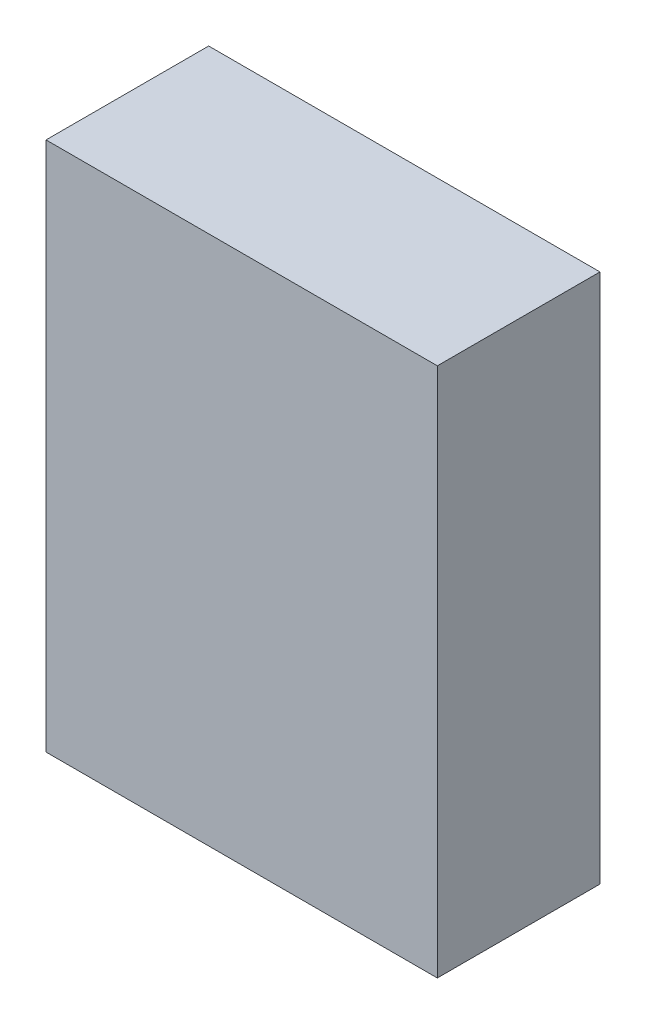
ISO-10303-21;
HEADER;
FILE_DESCRIPTION(('STEP AP214'),'2;1');
FILE_NAME('part.step','',(''),(''),'','','');
FILE_SCHEMA(('AUTOMOTIVE_DESIGN { 1 0 10303 214 1 1 1 1 }'));
ENDSEC;
DATA;
#1=APPLICATION_CONTEXT('core data for automotive mechanical design processes');
#2=APPLICATION_PROTOCOL_DEFINITION('international standard','automotive_design',2000,#1);
#3=PRODUCT_CONTEXT('',#1,'mechanical');
#4=PRODUCT('Part','Part','',(#3));
#5=PRODUCT_RELATED_PRODUCT_CATEGORY('part','',(#4));
#6=PRODUCT_DEFINITION_FORMATION('','',#4);
#7=PRODUCT_DEFINITION_CONTEXT('part definition',#1,'design');
#8=PRODUCT_DEFINITION('design','',#6,#7);
#9=PRODUCT_DEFINITION_SHAPE('','',#8);
#10=(LENGTH_UNIT() NAMED_UNIT(*) SI_UNIT(.MILLI.,.METRE.));
#11=(NAMED_UNIT(*) PLANE_ANGLE_UNIT() SI_UNIT($,.RADIAN.));
#12=(NAMED_UNIT(*) SI_UNIT($,.STERADIAN.) SOLID_ANGLE_UNIT());
#13=UNCERTAINTY_MEASURE_WITH_UNIT(LENGTH_MEASURE(1.E-05),#10,'distance_accuracy_value','');
#14=(GEOMETRIC_REPRESENTATION_CONTEXT(3) GLOBAL_UNCERTAINTY_ASSIGNED_CONTEXT((#13)) GLOBAL_UNIT_ASSIGNED_CONTEXT((#10,
#11,#12)) REPRESENTATION_CONTEXT('',''));
#15=CARTESIAN_POINT('',(0.,0.,0.));
#16=DIRECTION('',(0.,0.,1.));
#17=DIRECTION('',(1.,0.,0.));
#18=AXIS2_PLACEMENT_3D('',#15,#16,#17);
#19=CARTESIAN_POINT('',(0.27500072,-0.37260022,0.2286));
#20=DIRECTION('',(0.,0.,-1.));
#21=DIRECTION('',(-1.,0.,0.));
#22=AXIS2_PLACEMENT_3D('',#19,#20,#21);
#23=PLANE('',#22);
#24=DIRECTION('',(1.,0.,0.));
#25=VECTOR('',#24,1.);
#26=CARTESIAN_POINT('',(0.27500072,0.37260276,0.2286));
#27=LINE('',#26,#25);
#28=CARTESIAN_POINT('',(0.27500072,0.37260276,0.2286));
#29=VERTEX_POINT('',#28);
#30=CARTESIAN_POINT('',(-0.27500072,0.37260276,0.2286));
#31=VERTEX_POINT('',#30);
#32=EDGE_CURVE('E55',#29,#31,#27,.F.);
#33=ORIENTED_EDGE('',*,*,#32,.T.);
#34=DIRECTION('',(0.,1.,0.));
#35=VECTOR('',#34,1.);
#36=CARTESIAN_POINT('',(-0.27500072,0.37260276,0.2286));
#37=LINE('',#36,#35);
#38=CARTESIAN_POINT('',(-0.27500072,-0.37260149,0.2286));
#39=VERTEX_POINT('',#38);
#40=EDGE_CURVE('E57',#31,#39,#37,.F.);
#41=ORIENTED_EDGE('',*,*,#40,.T.);
#42=DIRECTION('',(-0.999999999989336,-4.61816972146955E-06,0.));
#43=VECTOR('',#42,1.);
#44=CARTESIAN_POINT('',(-0.27500072,-0.37260276,0.2286));
#45=LINE('',#44,#43);
#46=CARTESIAN_POINT('',(0.27500072,-0.372600220000001,0.2286));
#47=VERTEX_POINT('',#46);
#48=EDGE_CURVE('E20',#39,#47,#45,.F.);
#49=ORIENTED_EDGE('',*,*,#48,.T.);
#50=DIRECTION('',(0.,1.,0.));
#51=VECTOR('',#50,1.);
#52=CARTESIAN_POINT('',(0.27500072,-0.37260022,0.2286));
#53=LINE('',#52,#51);
#54=EDGE_CURVE('E80',#47,#29,#53,.T.);
#55=ORIENTED_EDGE('',*,*,#54,.T.);
#56=EDGE_LOOP('',(#33,#41,#49,#55));
#57=FACE_BOUND('',#56,.T.);
#58=ADVANCED_FACE('F17',(#57),#23,.F.);
#59=CARTESIAN_POINT('',(-0.27500072,-0.37260276,0.));
#60=DIRECTION('',(-4.61816972146955E-06,0.999999999989336,0.));
#61=DIRECTION('',(-0.999999999989336,-4.61816972146955E-06,0.));
#62=AXIS2_PLACEMENT_3D('',#59,#60,#61);
#63=PLANE('',#62);
#64=DIRECTION('',(0.,0.,1.));
#65=VECTOR('',#64,1.);
#66=CARTESIAN_POINT('',(0.27500072,-0.37260022,0.));
#67=LINE('',#66,#65);
#68=CARTESIAN_POINT('',(0.27500072,-0.372600220000001,0.));
#69=VERTEX_POINT('',#68);
#70=EDGE_CURVE('E68',#69,#47,#67,.T.);
#71=ORIENTED_EDGE('',*,*,#70,.T.);
#72=ORIENTED_EDGE('',*,*,#48,.F.);
#73=DIRECTION('',(0.,0.,-1.));
#74=VECTOR('',#73,1.);
#75=CARTESIAN_POINT('',(-0.27500072,-0.37260276,0.));
#76=LINE('',#75,#74);
#77=CARTESIAN_POINT('',(-0.27500072,-0.372602125,0.));
#78=VERTEX_POINT('',#77);
#79=EDGE_CURVE('E63',#39,#78,#76,.T.);
#80=ORIENTED_EDGE('',*,*,#79,.T.);
#81=DIRECTION('',(-1.,0.,0.));
#82=VECTOR('',#81,1.);
#83=CARTESIAN_POINT('',(0.27500072,-0.37260022,0.));
#84=LINE('',#83,#82);
#85=EDGE_CURVE('E83',#69,#78,#84,.T.);
#86=ORIENTED_EDGE('',*,*,#85,.F.);
#87=EDGE_LOOP('',(#71,#72,#80,#86));
#88=FACE_BOUND('',#87,.T.);
#89=ADVANCED_FACE('F65',(#88),#63,.F.);
#90=CARTESIAN_POINT('',(-0.27500072,0.37260276,0.));
#91=DIRECTION('',(1.,0.,0.));
#92=DIRECTION('',(0.,0.,-1.));
#93=AXIS2_PLACEMENT_3D('',#90,#91,#92);
#94=PLANE('',#93);
#95=ORIENTED_EDGE('',*,*,#79,.F.);
#96=ORIENTED_EDGE('',*,*,#40,.F.);
#97=DIRECTION('',(0.,0.,-1.));
#98=VECTOR('',#97,1.);
#99=CARTESIAN_POINT('',(-0.27500072,0.37260276,0.));
#100=LINE('',#99,#98);
#101=CARTESIAN_POINT('',(-0.27500072,0.37260276,0.));
#102=VERTEX_POINT('',#101);
#103=EDGE_CURVE('E75',#31,#102,#100,.T.);
#104=ORIENTED_EDGE('',*,*,#103,.T.);
#105=DIRECTION('',(0.,1.,0.));
#106=VECTOR('',#105,1.);
#107=CARTESIAN_POINT('',(-0.27500072,-0.37260022,0.));
#108=LINE('',#107,#106);
#109=EDGE_CURVE('E72',#78,#102,#108,.T.);
#110=ORIENTED_EDGE('',*,*,#109,.F.);
#111=EDGE_LOOP('',(#95,#96,#104,#110));
#112=FACE_BOUND('',#111,.T.);
#113=ADVANCED_FACE('F70',(#112),#94,.F.);
#114=CARTESIAN_POINT('',(0.27500072,0.37260276,0.));
#115=DIRECTION('',(0.,-1.,0.));
#116=DIRECTION('',(0.,0.,-1.));
#117=AXIS2_PLACEMENT_3D('',#114,#115,#116);
#118=PLANE('',#117);
#119=ORIENTED_EDGE('',*,*,#103,.F.);
#120=ORIENTED_EDGE('',*,*,#32,.F.);
#121=DIRECTION('',(0.,0.,1.));
#122=VECTOR('',#121,1.);
#123=CARTESIAN_POINT('',(0.27500072,0.37260276,0.));
#124=LINE('',#123,#122);
#125=CARTESIAN_POINT('',(0.27500072,0.37260276,0.));
#126=VERTEX_POINT('',#125);
#127=EDGE_CURVE('E35',#29,#126,#124,.F.);
#128=ORIENTED_EDGE('',*,*,#127,.T.);
#129=DIRECTION('',(-1.,0.,0.));
#130=VECTOR('',#129,1.);
#131=CARTESIAN_POINT('',(0.27500072,0.37260276,0.));
#132=LINE('',#131,#130);
#133=EDGE_CURVE('E26',#102,#126,#132,.F.);
#134=ORIENTED_EDGE('',*,*,#133,.F.);
#135=EDGE_LOOP('',(#119,#120,#128,#134));
#136=FACE_BOUND('',#135,.T.);
#137=ADVANCED_FACE('F89',(#136),#118,.F.);
#138=CARTESIAN_POINT('',(0.27500072,-0.37260022,0.));
#139=DIRECTION('',(-1.,0.,0.));
#140=DIRECTION('',(0.,0.,1.));
#141=AXIS2_PLACEMENT_3D('',#138,#139,#140);
#142=PLANE('',#141);
#143=ORIENTED_EDGE('',*,*,#127,.F.);
#144=ORIENTED_EDGE('',*,*,#54,.F.);
#145=ORIENTED_EDGE('',*,*,#70,.F.);
#146=DIRECTION('',(0.,1.,0.));
#147=VECTOR('',#146,1.);
#148=CARTESIAN_POINT('',(0.27500072,-0.37260022,0.));
#149=LINE('',#148,#147);
#150=EDGE_CURVE('E11',#126,#69,#149,.F.);
#151=ORIENTED_EDGE('',*,*,#150,.F.);
#152=EDGE_LOOP('',(#143,#144,#145,#151));
#153=FACE_BOUND('',#152,.T.);
#154=ADVANCED_FACE('F91',(#153),#142,.F.);
#155=CARTESIAN_POINT('',(0.27500072,-0.37260022,0.));
#156=DIRECTION('',(0.,0.,-1.));
#157=DIRECTION('',(-1.,0.,0.));
#158=AXIS2_PLACEMENT_3D('',#155,#156,#157);
#159=PLANE('',#158);
#160=ORIENTED_EDGE('',*,*,#133,.T.);
#161=ORIENTED_EDGE('',*,*,#150,.T.);
#162=ORIENTED_EDGE('',*,*,#85,.T.);
#163=ORIENTED_EDGE('',*,*,#109,.T.);
#164=EDGE_LOOP('',(#160,#161,#162,#163));
#165=FACE_BOUND('',#164,.T.);
#166=ADVANCED_FACE('F88',(#165),#159,.T.);
#167=CLOSED_SHELL('',(#58,#89,#113,#137,#154,#166));
#168=MANIFOLD_SOLID_BREP('B1',#167);
#169=ADVANCED_BREP_SHAPE_REPRESENTATION('',(#18,#168),#14);
#170=SHAPE_DEFINITION_REPRESENTATION(#9,#169);
ENDSEC;
END-ISO-10303-21;
